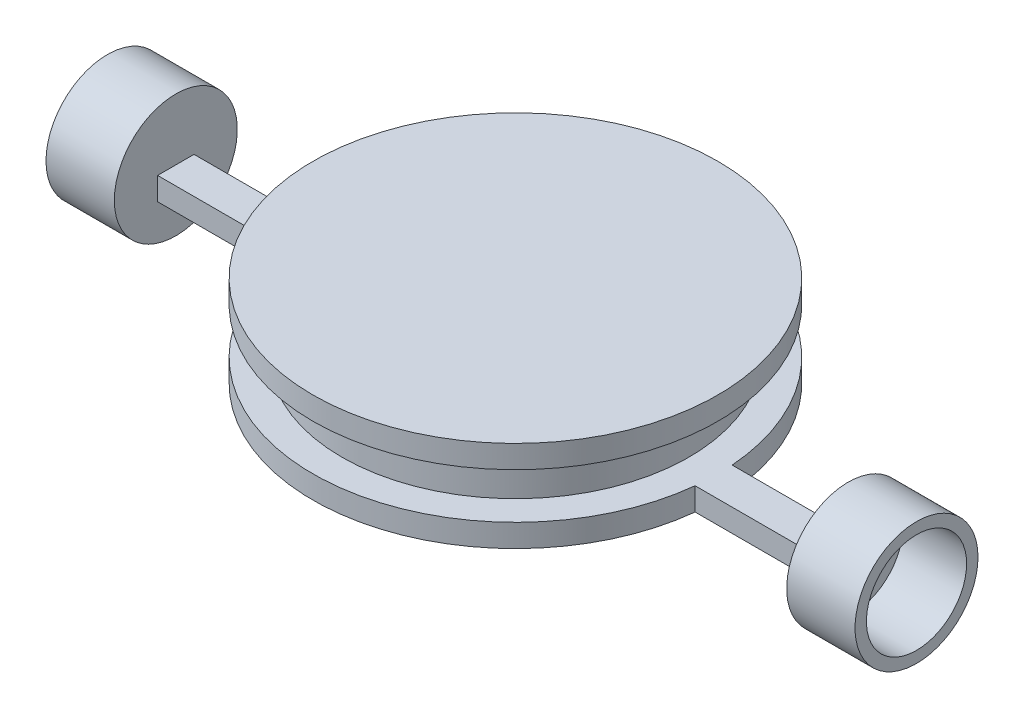
ISO-10303-21;
HEADER;
FILE_DESCRIPTION(('STEP AP214'),'2;1');
FILE_NAME('part.step','',(''),(''),'','','');
FILE_SCHEMA(('AUTOMOTIVE_DESIGN { 1 0 10303 214 1 1 1 1 }'));
ENDSEC;
DATA;
#1=APPLICATION_CONTEXT('core data for automotive mechanical design processes');
#2=APPLICATION_PROTOCOL_DEFINITION('international standard','automotive_design',2000,#1);
#3=PRODUCT_CONTEXT('',#1,'mechanical');
#4=PRODUCT('Part','Part','',(#3));
#5=PRODUCT_RELATED_PRODUCT_CATEGORY('part','',(#4));
#6=PRODUCT_DEFINITION_FORMATION('','',#4);
#7=PRODUCT_DEFINITION_CONTEXT('part definition',#1,'design');
#8=PRODUCT_DEFINITION('design','',#6,#7);
#9=PRODUCT_DEFINITION_SHAPE('','',#8);
#10=(LENGTH_UNIT() NAMED_UNIT(*) SI_UNIT(.MILLI.,.METRE.));
#11=(NAMED_UNIT(*) PLANE_ANGLE_UNIT() SI_UNIT($,.RADIAN.));
#12=(NAMED_UNIT(*) SI_UNIT($,.STERADIAN.) SOLID_ANGLE_UNIT());
#13=UNCERTAINTY_MEASURE_WITH_UNIT(LENGTH_MEASURE(1.E-05),#10,'distance_accuracy_value','');
#14=(GEOMETRIC_REPRESENTATION_CONTEXT(3) GLOBAL_UNCERTAINTY_ASSIGNED_CONTEXT((#13)) GLOBAL_UNIT_ASSIGNED_CONTEXT((#10,
#11,#12)) REPRESENTATION_CONTEXT('',''));
#15=CARTESIAN_POINT('',(0.,0.,0.));
#16=DIRECTION('',(0.,0.,1.));
#17=DIRECTION('',(1.,0.,0.));
#18=AXIS2_PLACEMENT_3D('',#15,#16,#17);
#19=CARTESIAN_POINT('',(0.,5.,0.));
#20=DIRECTION('',(0.,-1.,0.));
#21=DIRECTION('',(0.,0.,-1.));
#22=AXIS2_PLACEMENT_3D('',#19,#20,#21);
#23=CYLINDRICAL_SURFACE('',#22,44.45);
#24=CARTESIAN_POINT('',(0.,0.,0.));
#25=DIRECTION('',(0.,1.,0.));
#26=DIRECTION('',(0.,0.,1.));
#27=AXIS2_PLACEMENT_3D('',#24,#25,#26);
#28=CIRCLE('',#27,44.45);
#29=CARTESIAN_POINT('',(-44.1953352847068,0.,4.75129867218961));
#30=VERTEX_POINT('',#29);
#31=CARTESIAN_POINT('',(44.1953352847068,0.,4.75129867218961));
#32=VERTEX_POINT('',#31);
#33=EDGE_CURVE('E45',#30,#32,#28,.T.);
#34=ORIENTED_EDGE('',*,*,#33,.T.);
#35=DIRECTION('',(0.,-1.,0.));
#36=VECTOR('',#35,1.);
#37=CARTESIAN_POINT('',(44.1953352847068,5.,4.75129867218961));
#38=LINE('',#37,#36);
#39=CARTESIAN_POINT('',(44.1953352847068,5.,4.75129867218961));
#40=VERTEX_POINT('',#39);
#41=EDGE_CURVE('E67',#40,#32,#38,.T.);
#42=ORIENTED_EDGE('',*,*,#41,.F.);
#43=CARTESIAN_POINT('',(0.,5.,0.));
#44=DIRECTION('',(0.,1.,0.));
#45=DIRECTION('',(0.,0.,1.));
#46=AXIS2_PLACEMENT_3D('',#43,#44,#45);
#47=CIRCLE('',#46,44.45);
#48=CARTESIAN_POINT('',(-44.1953352847068,5.,4.75129867218961));
#49=VERTEX_POINT('',#48);
#50=EDGE_CURVE('E51',#49,#40,#47,.T.);
#51=ORIENTED_EDGE('',*,*,#50,.F.);
#52=DIRECTION('',(0.,-1.,0.));
#53=VECTOR('',#52,1.);
#54=CARTESIAN_POINT('',(-44.1953352847068,5.,4.75129867218961));
#55=LINE('',#54,#53);
#56=EDGE_CURVE('E156',#49,#30,#55,.T.);
#57=ORIENTED_EDGE('',*,*,#56,.T.);
#58=EDGE_LOOP('',(#34,#42,#51,#57));
#59=FACE_BOUND('',#58,.T.);
#60=ADVANCED_FACE('F41',(#59),#23,.T.);
#61=CARTESIAN_POINT('',(44.331122698198,5.,-3.24870132781039));
#62=VERTEX_POINT('',#61);
#63=CARTESIAN_POINT('',(-44.331122698198,5.,-3.24870132781039));
#64=VERTEX_POINT('',#63);
#65=EDGE_CURVE('E59',#62,#64,#47,.T.);
#66=ORIENTED_EDGE('',*,*,#65,.F.);
#67=DIRECTION('',(0.,-1.,0.));
#68=VECTOR('',#67,1.);
#69=CARTESIAN_POINT('',(44.331122698198,5.,-3.24870132781039));
#70=LINE('',#69,#68);
#71=CARTESIAN_POINT('',(44.331122698198,0.,-3.24870132781039));
#72=VERTEX_POINT('',#71);
#73=EDGE_CURVE('E141',#62,#72,#70,.T.);
#74=ORIENTED_EDGE('',*,*,#73,.T.);
#75=CARTESIAN_POINT('',(-44.331122698198,0.,-3.24870132781039));
#76=VERTEX_POINT('',#75);
#77=EDGE_CURVE('E192',#72,#76,#28,.T.);
#78=ORIENTED_EDGE('',*,*,#77,.T.);
#79=DIRECTION('',(0.,-1.,0.));
#80=VECTOR('',#79,1.);
#81=CARTESIAN_POINT('',(-44.331122698198,5.,-3.24870132781039));
#82=LINE('',#81,#80);
#83=EDGE_CURVE('E177',#64,#76,#82,.T.);
#84=ORIENTED_EDGE('',*,*,#83,.F.);
#85=EDGE_LOOP('',(#66,#74,#78,#84));
#86=FACE_BOUND('',#85,.T.);
#87=ADVANCED_FACE('F43',(#86),#23,.T.);
#88=CARTESIAN_POINT('',(0.,5.,0.));
#89=DIRECTION('',(0.,1.,0.));
#90=DIRECTION('',(0.,0.,1.));
#91=AXIS2_PLACEMENT_3D('',#88,#89,#90);
#92=PLANE('',#91);
#93=CARTESIAN_POINT('',(0.,5.,0.));
#94=DIRECTION('',(0.,1.,0.));
#95=DIRECTION('',(0.,0.,1.));
#96=AXIS2_PLACEMENT_3D('',#93,#94,#95);
#97=CIRCLE('',#96,38.1);
#98=CARTESIAN_POINT('',(0.,5.,38.1));
#99=VERTEX_POINT('',#98);
#100=EDGE_CURVE('E11',#99,#99,#97,.T.);
#101=ORIENTED_EDGE('',*,*,#100,.F.);
#102=EDGE_LOOP('',(#101));
#103=FACE_BOUND('',#102,.T.);
#104=ORIENTED_EDGE('',*,*,#50,.T.);
#105=DIRECTION('',(-1.,0.,0.));
#106=VECTOR('',#105,1.);
#107=CARTESIAN_POINT('',(0.,5.,4.75129867218961));
#108=LINE('',#107,#106);
#109=CARTESIAN_POINT('',(73.8054493127841,5.,4.75129867218961));
#110=VERTEX_POINT('',#109);
#111=EDGE_CURVE('E325',#110,#40,#108,.T.);
#112=ORIENTED_EDGE('',*,*,#111,.F.);
#113=DIRECTION('',(0.,0.,1.));
#114=VECTOR('',#113,1.);
#115=CARTESIAN_POINT('',(73.8054493127841,5.,0.));
#116=LINE('',#115,#114);
#117=CARTESIAN_POINT('',(73.8054493127841,5.,-3.24870132781039));
#118=VERTEX_POINT('',#117);
#119=EDGE_CURVE('E133',#118,#110,#116,.T.);
#120=ORIENTED_EDGE('',*,*,#119,.F.);
#121=DIRECTION('',(1.,0.,0.));
#122=VECTOR('',#121,1.);
#123=CARTESIAN_POINT('',(0.,5.,-3.2487013278104));
#124=LINE('',#123,#122);
#125=EDGE_CURVE('E330',#62,#118,#124,.T.);
#126=ORIENTED_EDGE('',*,*,#125,.F.);
#127=ORIENTED_EDGE('',*,*,#65,.T.);
#128=DIRECTION('',(-1.,0.,0.));
#129=VECTOR('',#128,1.);
#130=CARTESIAN_POINT('',(0.,5.,-3.2487013278104));
#131=LINE('',#130,#129);
#132=CARTESIAN_POINT('',(-73.8054493127841,5.,-3.24870132781039));
#133=VERTEX_POINT('',#132);
#134=EDGE_CURVE('E145',#64,#133,#131,.T.);
#135=ORIENTED_EDGE('',*,*,#134,.T.);
#136=DIRECTION('',(0.,0.,1.));
#137=VECTOR('',#136,1.);
#138=CARTESIAN_POINT('',(-73.8054493127841,5.,0.));
#139=LINE('',#138,#137);
#140=CARTESIAN_POINT('',(-73.8054493127841,5.,4.75129867218961));
#141=VERTEX_POINT('',#140);
#142=EDGE_CURVE('E148',#133,#141,#139,.T.);
#143=ORIENTED_EDGE('',*,*,#142,.T.);
#144=DIRECTION('',(1.,0.,0.));
#145=VECTOR('',#144,1.);
#146=CARTESIAN_POINT('',(0.,5.,4.75129867218961));
#147=LINE('',#146,#145);
#148=EDGE_CURVE('E152',#141,#49,#147,.T.);
#149=ORIENTED_EDGE('',*,*,#148,.T.);
#150=EDGE_LOOP('',(#104,#112,#120,#126,#127,#135,#143,#149));
#151=FACE_BOUND('',#150,.T.);
#152=ADVANCED_FACE('F210',(#103,#151),#92,.T.);
#153=CARTESIAN_POINT('',(0.,0.,0.));
#154=DIRECTION('',(0.,1.,0.));
#155=DIRECTION('',(0.,0.,1.));
#156=AXIS2_PLACEMENT_3D('',#153,#154,#155);
#157=PLANE('',#156);
#158=ORIENTED_EDGE('',*,*,#33,.F.);
#159=DIRECTION('',(1.,0.,0.));
#160=VECTOR('',#159,1.);
#161=CARTESIAN_POINT('',(0.,0.,4.75129867218961));
#162=LINE('',#161,#160);
#163=CARTESIAN_POINT('',(-73.8054493127841,0.,4.75129867218961));
#164=VERTEX_POINT('',#163);
#165=EDGE_CURVE('E149',#164,#30,#162,.T.);
#166=ORIENTED_EDGE('',*,*,#165,.F.);
#167=DIRECTION('',(0.,0.,1.));
#168=VECTOR('',#167,1.);
#169=CARTESIAN_POINT('',(-73.8054493127841,0.,0.));
#170=LINE('',#169,#168);
#171=CARTESIAN_POINT('',(-73.8054493127841,0.,-3.24870132781039));
#172=VERTEX_POINT('',#171);
#173=EDGE_CURVE('E160',#172,#164,#170,.T.);
#174=ORIENTED_EDGE('',*,*,#173,.F.);
#175=DIRECTION('',(-1.,0.,0.));
#176=VECTOR('',#175,1.);
#177=CARTESIAN_POINT('',(0.,0.,-3.2487013278104));
#178=LINE('',#177,#176);
#179=EDGE_CURVE('E139',#76,#172,#178,.T.);
#180=ORIENTED_EDGE('',*,*,#179,.F.);
#181=ORIENTED_EDGE('',*,*,#77,.F.);
#182=DIRECTION('',(1.,0.,0.));
#183=VECTOR('',#182,1.);
#184=CARTESIAN_POINT('',(0.,0.,-3.2487013278104));
#185=LINE('',#184,#183);
#186=CARTESIAN_POINT('',(73.8054493127841,0.,-3.24870132781039));
#187=VERTEX_POINT('',#186);
#188=EDGE_CURVE('E116',#72,#187,#185,.T.);
#189=ORIENTED_EDGE('',*,*,#188,.T.);
#190=DIRECTION('',(0.,0.,1.));
#191=VECTOR('',#190,1.);
#192=CARTESIAN_POINT('',(73.8054493127841,0.,0.));
#193=LINE('',#192,#191);
#194=CARTESIAN_POINT('',(73.8054493127841,0.,4.75129867218961));
#195=VERTEX_POINT('',#194);
#196=EDGE_CURVE('E111',#187,#195,#193,.T.);
#197=ORIENTED_EDGE('',*,*,#196,.T.);
#198=DIRECTION('',(-1.,0.,0.));
#199=VECTOR('',#198,1.);
#200=CARTESIAN_POINT('',(0.,0.,4.75129867218961));
#201=LINE('',#200,#199);
#202=EDGE_CURVE('E114',#195,#32,#201,.T.);
#203=ORIENTED_EDGE('',*,*,#202,.T.);
#204=EDGE_LOOP('',(#158,#166,#174,#180,#181,#189,#197,#203));
#205=FACE_BOUND('',#204,.T.);
#206=ADVANCED_FACE('F113',(#205),#157,.F.);
#207=CARTESIAN_POINT('',(0.,15.,0.));
#208=DIRECTION('',(0.,-1.,0.));
#209=DIRECTION('',(0.,0.,-1.));
#210=AXIS2_PLACEMENT_3D('',#207,#208,#209);
#211=CYLINDRICAL_SURFACE('',#210,38.1);
#212=CARTESIAN_POINT('',(0.,15.,0.));
#213=DIRECTION('',(0.,1.,0.));
#214=DIRECTION('',(0.,0.,1.));
#215=AXIS2_PLACEMENT_3D('',#212,#213,#214);
#216=CIRCLE('',#215,38.1);
#217=CARTESIAN_POINT('',(0.,15.,38.1));
#218=VERTEX_POINT('',#217);
#219=EDGE_CURVE('E186',#218,#218,#216,.T.);
#220=ORIENTED_EDGE('',*,*,#219,.F.);
#221=EDGE_LOOP('',(#220));
#222=FACE_BOUND('',#221,.T.);
#223=ORIENTED_EDGE('',*,*,#100,.T.);
#224=EDGE_LOOP('',(#223));
#225=FACE_BOUND('',#224,.T.);
#226=ADVANCED_FACE('F226',(#222,#225),#211,.T.);
#227=CARTESIAN_POINT('',(0.,20.,0.));
#228=DIRECTION('',(0.,-1.,0.));
#229=DIRECTION('',(0.,0.,-1.));
#230=AXIS2_PLACEMENT_3D('',#227,#228,#229);
#231=CYLINDRICAL_SURFACE('',#230,44.45);
#232=CARTESIAN_POINT('',(0.,20.,0.));
#233=DIRECTION('',(0.,1.,0.));
#234=DIRECTION('',(0.,0.,1.));
#235=AXIS2_PLACEMENT_3D('',#232,#233,#234);
#236=CIRCLE('',#235,44.45);
#237=CARTESIAN_POINT('',(0.,20.,44.45));
#238=VERTEX_POINT('',#237);
#239=EDGE_CURVE('E182',#238,#238,#236,.T.);
#240=ORIENTED_EDGE('',*,*,#239,.F.);
#241=EDGE_LOOP('',(#240));
#242=FACE_BOUND('',#241,.T.);
#243=CARTESIAN_POINT('',(0.,15.,0.));
#244=DIRECTION('',(0.,1.,0.));
#245=DIRECTION('',(0.,0.,1.));
#246=AXIS2_PLACEMENT_3D('',#243,#244,#245);
#247=CIRCLE('',#246,44.45);
#248=CARTESIAN_POINT('',(0.,15.,44.45));
#249=VERTEX_POINT('',#248);
#250=EDGE_CURVE('E181',#249,#249,#247,.T.);
#251=ORIENTED_EDGE('',*,*,#250,.T.);
#252=EDGE_LOOP('',(#251));
#253=FACE_BOUND('',#252,.T.);
#254=ADVANCED_FACE('F231',(#242,#253),#231,.T.);
#255=CARTESIAN_POINT('',(0.,20.,0.));
#256=DIRECTION('',(0.,1.,0.));
#257=DIRECTION('',(0.,0.,1.));
#258=AXIS2_PLACEMENT_3D('',#255,#256,#257);
#259=PLANE('',#258);
#260=ORIENTED_EDGE('',*,*,#239,.T.);
#261=EDGE_LOOP('',(#260));
#262=FACE_BOUND('',#261,.T.);
#263=ADVANCED_FACE('F235',(#262),#259,.T.);
#264=CARTESIAN_POINT('',(0.,15.,0.));
#265=DIRECTION('',(0.,1.,0.));
#266=DIRECTION('',(0.,0.,1.));
#267=AXIS2_PLACEMENT_3D('',#264,#265,#266);
#268=PLANE('',#267);
#269=ORIENTED_EDGE('',*,*,#219,.T.);
#270=EDGE_LOOP('',(#269));
#271=FACE_BOUND('',#270,.T.);
#272=ORIENTED_EDGE('',*,*,#250,.F.);
#273=EDGE_LOOP('',(#272));
#274=FACE_BOUND('',#273,.T.);
#275=ADVANCED_FACE('F237',(#271,#274),#268,.F.);
#276=CARTESIAN_POINT('',(0.,5.,-3.2487013278104));
#277=DIRECTION('',(0.,0.,1.));
#278=DIRECTION('',(1.,0.,0.));
#279=AXIS2_PLACEMENT_3D('',#276,#277,#278);
#280=PLANE('',#279);
#281=ORIENTED_EDGE('',*,*,#179,.T.);
#282=DIRECTION('',(0.,-1.,0.));
#283=VECTOR('',#282,1.);
#284=CARTESIAN_POINT('',(-73.8054493127841,5.,-3.24870132781039));
#285=LINE('',#284,#283);
#286=EDGE_CURVE('E173',#133,#172,#285,.T.);
#287=ORIENTED_EDGE('',*,*,#286,.F.);
#288=ORIENTED_EDGE('',*,*,#134,.F.);
#289=ORIENTED_EDGE('',*,*,#83,.T.);
#290=EDGE_LOOP('',(#281,#287,#288,#289));
#291=FACE_BOUND('',#290,.T.);
#292=ADVANCED_FACE('F202',(#291),#280,.F.);
#293=CARTESIAN_POINT('',(0.,5.,4.75129867218961));
#294=DIRECTION('',(0.,0.,-1.));
#295=DIRECTION('',(-1.,0.,0.));
#296=AXIS2_PLACEMENT_3D('',#293,#294,#295);
#297=PLANE('',#296);
#298=ORIENTED_EDGE('',*,*,#165,.T.);
#299=ORIENTED_EDGE('',*,*,#56,.F.);
#300=ORIENTED_EDGE('',*,*,#148,.F.);
#301=DIRECTION('',(0.,-1.,0.));
#302=VECTOR('',#301,1.);
#303=CARTESIAN_POINT('',(-73.8054493127841,5.,4.75129867218961));
#304=LINE('',#303,#302);
#305=EDGE_CURVE('E170',#141,#164,#304,.T.);
#306=ORIENTED_EDGE('',*,*,#305,.T.);
#307=EDGE_LOOP('',(#298,#299,#300,#306));
#308=FACE_BOUND('',#307,.T.);
#309=ADVANCED_FACE('F213',(#308),#297,.F.);
#310=CARTESIAN_POINT('',(0.,5.,4.75129867218961));
#311=DIRECTION('',(0.,0.,1.));
#312=DIRECTION('',(1.,0.,0.));
#313=AXIS2_PLACEMENT_3D('',#310,#311,#312);
#314=PLANE('',#313);
#315=ORIENTED_EDGE('',*,*,#202,.F.);
#316=DIRECTION('',(0.,-1.,0.));
#317=VECTOR('',#316,1.);
#318=CARTESIAN_POINT('',(73.8054493127841,5.,4.75129867218961));
#319=LINE('',#318,#317);
#320=EDGE_CURVE('E125',#110,#195,#319,.T.);
#321=ORIENTED_EDGE('',*,*,#320,.F.);
#322=ORIENTED_EDGE('',*,*,#111,.T.);
#323=ORIENTED_EDGE('',*,*,#41,.T.);
#324=EDGE_LOOP('',(#315,#321,#322,#323));
#325=FACE_BOUND('',#324,.T.);
#326=ADVANCED_FACE('F123',(#325),#314,.T.);
#327=CARTESIAN_POINT('',(0.,5.,-3.2487013278104));
#328=DIRECTION('',(0.,0.,-1.));
#329=DIRECTION('',(-1.,0.,0.));
#330=AXIS2_PLACEMENT_3D('',#327,#328,#329);
#331=PLANE('',#330);
#332=ORIENTED_EDGE('',*,*,#188,.F.);
#333=ORIENTED_EDGE('',*,*,#73,.F.);
#334=ORIENTED_EDGE('',*,*,#125,.T.);
#335=DIRECTION('',(0.,-1.,0.));
#336=VECTOR('',#335,1.);
#337=CARTESIAN_POINT('',(73.8054493127841,5.,-3.24870132781039));
#338=LINE('',#337,#336);
#339=EDGE_CURVE('E135',#118,#187,#338,.T.);
#340=ORIENTED_EDGE('',*,*,#339,.T.);
#341=EDGE_LOOP('',(#332,#333,#334,#340));
#342=FACE_BOUND('',#341,.T.);
#343=ADVANCED_FACE('F250',(#342),#331,.T.);
#344=CARTESIAN_POINT('',(-73.8054493127841,5.,0.751298672189612));
#345=DIRECTION('',(-1.,0.,0.));
#346=DIRECTION('',(0.,0.,1.));
#347=AXIS2_PLACEMENT_3D('',#344,#345,#346);
#348=PLANE('',#347);
#349=CARTESIAN_POINT('',(-73.8054493127841,5.,0.751298672189612));
#350=DIRECTION('',(-1.,0.,0.));
#351=DIRECTION('',(0.,0.,1.));
#352=AXIS2_PLACEMENT_3D('',#349,#350,#351);
#353=CIRCLE('',#352,13.5);
#354=CARTESIAN_POINT('',(-73.8054493127841,5.,14.2512986721896));
#355=VERTEX_POINT('',#354);
#356=EDGE_CURVE('E315',#355,#355,#353,.T.);
#357=ORIENTED_EDGE('',*,*,#356,.F.);
#358=EDGE_LOOP('',(#357));
#359=FACE_BOUND('',#358,.T.);
#360=ORIENTED_EDGE('',*,*,#286,.T.);
#361=ORIENTED_EDGE('',*,*,#173,.T.);
#362=ORIENTED_EDGE('',*,*,#305,.F.);
#363=ORIENTED_EDGE('',*,*,#142,.F.);
#364=EDGE_LOOP('',(#360,#361,#362,#363));
#365=FACE_BOUND('',#364,.T.);
#366=ADVANCED_FACE('F207',(#359,#365),#348,.F.);
#367=CARTESIAN_POINT('',(-88.8054493127841,5.,0.751298672189612));
#368=DIRECTION('',(1.,0.,0.));
#369=DIRECTION('',(0.,0.,-1.));
#370=AXIS2_PLACEMENT_3D('',#367,#368,#369);
#371=CYLINDRICAL_SURFACE('',#370,13.5);
#372=CARTESIAN_POINT('',(-88.8054493127841,5.,0.751298672189612));
#373=DIRECTION('',(-1.,0.,0.));
#374=DIRECTION('',(0.,0.,1.));
#375=AXIS2_PLACEMENT_3D('',#372,#373,#374);
#376=CIRCLE('',#375,13.5);
#377=CARTESIAN_POINT('',(-88.8054493127841,5.,14.2512986721896));
#378=VERTEX_POINT('',#377);
#379=EDGE_CURVE('E128',#378,#378,#376,.T.);
#380=ORIENTED_EDGE('',*,*,#379,.F.);
#381=EDGE_LOOP('',(#380));
#382=FACE_BOUND('',#381,.T.);
#383=ORIENTED_EDGE('',*,*,#356,.T.);
#384=EDGE_LOOP('',(#383));
#385=FACE_BOUND('',#384,.T.);
#386=ADVANCED_FACE('F254',(#382,#385),#371,.T.);
#387=CARTESIAN_POINT('',(-88.8054493127841,5.,0.751298672189612));
#388=DIRECTION('',(-1.,0.,0.));
#389=DIRECTION('',(0.,0.,1.));
#390=AXIS2_PLACEMENT_3D('',#387,#388,#389);
#391=PLANE('',#390);
#392=CARTESIAN_POINT('',(-88.8054493127841,5.,0.751298672189612));
#393=DIRECTION('',(-1.,0.,0.));
#394=DIRECTION('',(0.,0.,1.));
#395=AXIS2_PLACEMENT_3D('',#392,#393,#394);
#396=CIRCLE('',#395,11.);
#397=CARTESIAN_POINT('',(-88.8054493127841,5.,11.7512986721896));
#398=VERTEX_POINT('',#397);
#399=EDGE_CURVE('E297',#398,#398,#396,.T.);
#400=ORIENTED_EDGE('',*,*,#399,.F.);
#401=EDGE_LOOP('',(#400));
#402=FACE_BOUND('',#401,.T.);
#403=ORIENTED_EDGE('',*,*,#379,.T.);
#404=EDGE_LOOP('',(#403));
#405=FACE_BOUND('',#404,.T.);
#406=ADVANCED_FACE('F257',(#402,#405),#391,.T.);
#407=CARTESIAN_POINT('',(88.8054493127841,5.,0.751298672189612));
#408=DIRECTION('',(-1.,0.,0.));
#409=DIRECTION('',(0.,0.,1.));
#410=AXIS2_PLACEMENT_3D('',#407,#408,#409);
#411=CYLINDRICAL_SURFACE('',#410,13.5);
#412=CARTESIAN_POINT('',(88.8054493127841,5.,0.751298672189612));
#413=DIRECTION('',(1.,0.,0.));
#414=DIRECTION('',(0.,0.,-1.));
#415=AXIS2_PLACEMENT_3D('',#412,#413,#414);
#416=CIRCLE('',#415,13.5);
#417=CARTESIAN_POINT('',(88.8054493127841,5.,-12.7487013278104));
#418=VERTEX_POINT('',#417);
#419=EDGE_CURVE('E311',#418,#418,#416,.T.);
#420=ORIENTED_EDGE('',*,*,#419,.F.);
#421=EDGE_LOOP('',(#420));
#422=FACE_BOUND('',#421,.T.);
#423=CARTESIAN_POINT('',(73.8054493127841,5.,0.751298672189612));
#424=DIRECTION('',(1.,0.,0.));
#425=DIRECTION('',(0.,0.,-1.));
#426=AXIS2_PLACEMENT_3D('',#423,#424,#425);
#427=CIRCLE('',#426,13.5);
#428=CARTESIAN_POINT('',(73.8054493127841,5.,-12.7487013278104));
#429=VERTEX_POINT('',#428);
#430=EDGE_CURVE('E309',#429,#429,#427,.T.);
#431=ORIENTED_EDGE('',*,*,#430,.T.);
#432=EDGE_LOOP('',(#431));
#433=FACE_BOUND('',#432,.T.);
#434=ADVANCED_FACE('F264',(#422,#433),#411,.T.);
#435=CARTESIAN_POINT('',(88.8054493127841,5.,0.751298672189612));
#436=DIRECTION('',(1.,0.,0.));
#437=DIRECTION('',(0.,0.,-1.));
#438=AXIS2_PLACEMENT_3D('',#435,#436,#437);
#439=PLANE('',#438);
#440=CARTESIAN_POINT('',(88.8054493127841,5.,0.751298672189612));
#441=DIRECTION('',(1.,0.,0.));
#442=DIRECTION('',(0.,0.,-1.));
#443=AXIS2_PLACEMENT_3D('',#440,#441,#442);
#444=CIRCLE('',#443,11.);
#445=CARTESIAN_POINT('',(88.8054493127841,5.,-10.2487013278104));
#446=VERTEX_POINT('',#445);
#447=EDGE_CURVE('E296',#446,#446,#444,.T.);
#448=ORIENTED_EDGE('',*,*,#447,.F.);
#449=EDGE_LOOP('',(#448));
#450=FACE_BOUND('',#449,.T.);
#451=ORIENTED_EDGE('',*,*,#419,.T.);
#452=EDGE_LOOP('',(#451));
#453=FACE_BOUND('',#452,.T.);
#454=ADVANCED_FACE('F268',(#450,#453),#439,.T.);
#455=CARTESIAN_POINT('',(73.8054493127841,5.,0.751298672189612));
#456=DIRECTION('',(1.,0.,0.));
#457=DIRECTION('',(0.,0.,-1.));
#458=AXIS2_PLACEMENT_3D('',#455,#456,#457);
#459=PLANE('',#458);
#460=ORIENTED_EDGE('',*,*,#196,.F.);
#461=ORIENTED_EDGE('',*,*,#339,.F.);
#462=ORIENTED_EDGE('',*,*,#119,.T.);
#463=ORIENTED_EDGE('',*,*,#320,.T.);
#464=EDGE_LOOP('',(#460,#461,#462,#463));
#465=FACE_BOUND('',#464,.T.);
#466=ORIENTED_EDGE('',*,*,#430,.F.);
#467=EDGE_LOOP('',(#466));
#468=FACE_BOUND('',#467,.T.);
#469=ADVANCED_FACE('F131',(#465,#468),#459,.F.);
#470=CARTESIAN_POINT('',(74.8054493127841,5.,0.751298672189612));
#471=DIRECTION('',(1.,0.,0.));
#472=DIRECTION('',(0.,0.,-1.));
#473=AXIS2_PLACEMENT_3D('',#470,#471,#472);
#474=CYLINDRICAL_SURFACE('',#473,11.);
#475=CARTESIAN_POINT('',(74.8054493127841,5.,0.751298672189612));
#476=DIRECTION('',(1.,0.,0.));
#477=DIRECTION('',(0.,0.,-1.));
#478=AXIS2_PLACEMENT_3D('',#475,#476,#477);
#479=CIRCLE('',#478,11.);
#480=CARTESIAN_POINT('',(74.8054493127841,5.,-10.2487013278104));
#481=VERTEX_POINT('',#480);
#482=EDGE_CURVE('E302',#481,#481,#479,.T.);
#483=ORIENTED_EDGE('',*,*,#482,.F.);
#484=EDGE_LOOP('',(#483));
#485=FACE_BOUND('',#484,.T.);
#486=ORIENTED_EDGE('',*,*,#447,.T.);
#487=EDGE_LOOP('',(#486));
#488=FACE_BOUND('',#487,.T.);
#489=ADVANCED_FACE('F272',(#485,#488),#474,.F.);
#490=CARTESIAN_POINT('',(74.8054493127841,5.,0.751298672189612));
#491=DIRECTION('',(1.,0.,0.));
#492=DIRECTION('',(0.,0.,-1.));
#493=AXIS2_PLACEMENT_3D('',#490,#491,#492);
#494=PLANE('',#493);
#495=ORIENTED_EDGE('',*,*,#482,.T.);
#496=EDGE_LOOP('',(#495));
#497=FACE_BOUND('',#496,.T.);
#498=ADVANCED_FACE('F278',(#497),#494,.T.);
#499=CARTESIAN_POINT('',(-74.8054493127841,5.,0.751298672189612));
#500=DIRECTION('',(-1.,0.,0.));
#501=DIRECTION('',(0.,0.,1.));
#502=AXIS2_PLACEMENT_3D('',#499,#500,#501);
#503=CYLINDRICAL_SURFACE('',#502,11.);
#504=CARTESIAN_POINT('',(-74.8054493127841,5.,0.751298672189612));
#505=DIRECTION('',(-1.,0.,0.));
#506=DIRECTION('',(0.,0.,1.));
#507=AXIS2_PLACEMENT_3D('',#504,#505,#506);
#508=CIRCLE('',#507,11.);
#509=CARTESIAN_POINT('',(-74.8054493127841,5.,11.7512986721896));
#510=VERTEX_POINT('',#509);
#511=EDGE_CURVE('E294',#510,#510,#508,.T.);
#512=ORIENTED_EDGE('',*,*,#511,.F.);
#513=EDGE_LOOP('',(#512));
#514=FACE_BOUND('',#513,.T.);
#515=ORIENTED_EDGE('',*,*,#399,.T.);
#516=EDGE_LOOP('',(#515));
#517=FACE_BOUND('',#516,.T.);
#518=ADVANCED_FACE('F282',(#514,#517),#503,.F.);
#519=CARTESIAN_POINT('',(-74.8054493127841,5.,0.751298672189612));
#520=DIRECTION('',(-1.,0.,0.));
#521=DIRECTION('',(0.,0.,1.));
#522=AXIS2_PLACEMENT_3D('',#519,#520,#521);
#523=PLANE('',#522);
#524=ORIENTED_EDGE('',*,*,#511,.T.);
#525=EDGE_LOOP('',(#524));
#526=FACE_BOUND('',#525,.T.);
#527=ADVANCED_FACE('F286',(#526),#523,.T.);
#528=CLOSED_SHELL('',(#60,#87,#152,#206,#226,#254,#263,#275,#292,#309,#326,#343,#366,#386,#406,
#434,#454,#469,#489,#498,#518,#527));
#529=MANIFOLD_SOLID_BREP('B2',#528);
#530=ADVANCED_BREP_SHAPE_REPRESENTATION('',(#18,#529),#14);
#531=SHAPE_DEFINITION_REPRESENTATION(#9,#530);
ENDSEC;
END-ISO-10303-21;
